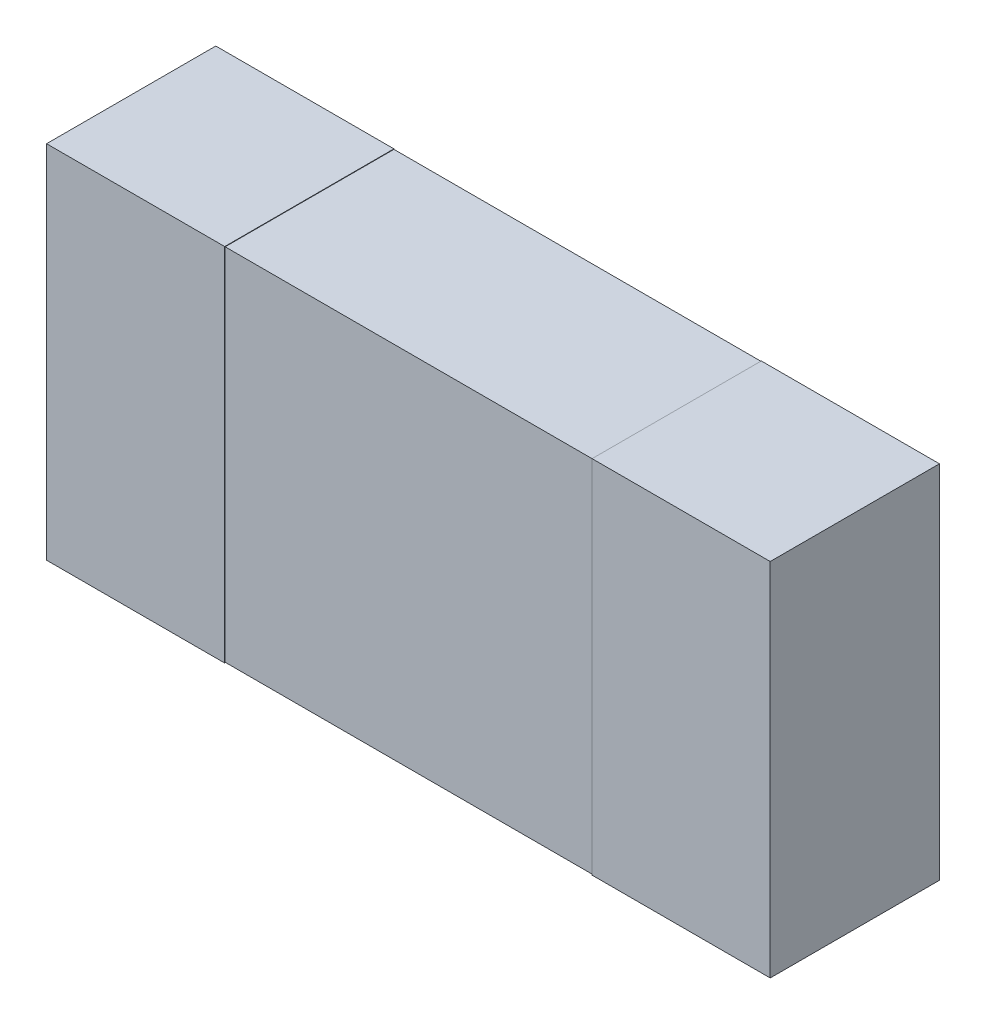
ISO-10303-21;
HEADER;
FILE_DESCRIPTION(('STEP AP214'),'2;1');
FILE_NAME('part.step','',(''),(''),'','','');
FILE_SCHEMA(('AUTOMOTIVE_DESIGN { 1 0 10303 214 1 1 1 1 }'));
ENDSEC;
DATA;
#1=APPLICATION_CONTEXT('core data for automotive mechanical design processes');
#2=APPLICATION_PROTOCOL_DEFINITION('international standard','automotive_design',2000,#1);
#3=PRODUCT_CONTEXT('',#1,'mechanical');
#4=PRODUCT('Part','Part','',(#3));
#5=PRODUCT_RELATED_PRODUCT_CATEGORY('part','',(#4));
#6=PRODUCT_DEFINITION_FORMATION('','',#4);
#7=PRODUCT_DEFINITION_CONTEXT('part definition',#1,'design');
#8=PRODUCT_DEFINITION('design','',#6,#7);
#9=PRODUCT_DEFINITION_SHAPE('','',#8);
#10=(LENGTH_UNIT() NAMED_UNIT(*) SI_UNIT(.MILLI.,.METRE.));
#11=(NAMED_UNIT(*) PLANE_ANGLE_UNIT() SI_UNIT($,.RADIAN.));
#12=(NAMED_UNIT(*) SI_UNIT($,.STERADIAN.) SOLID_ANGLE_UNIT());
#13=UNCERTAINTY_MEASURE_WITH_UNIT(LENGTH_MEASURE(1.E-05),#10,'distance_accuracy_value','');
#14=(GEOMETRIC_REPRESENTATION_CONTEXT(3) GLOBAL_UNCERTAINTY_ASSIGNED_CONTEXT((#13)) GLOBAL_UNIT_ASSIGNED_CONTEXT((#10,
#11,#12)) REPRESENTATION_CONTEXT('',''));
#15=CARTESIAN_POINT('',(0.,0.,0.));
#16=DIRECTION('',(0.,0.,1.));
#17=DIRECTION('',(1.,0.,0.));
#18=AXIS2_PLACEMENT_3D('',#15,#16,#17);
#19=CARTESIAN_POINT('',(0.,0.,0.38));
#20=DIRECTION('',(0.,0.,1.));
#21=DIRECTION('',(1.,0.,0.));
#22=AXIS2_PLACEMENT_3D('',#19,#20,#21);
#23=PLANE('',#22);
#24=DIRECTION('',(0.,-1.,0.));
#25=VECTOR('',#24,1.);
#26=CARTESIAN_POINT('',(0.8125,0.405,0.38));
#27=LINE('',#26,#25);
#28=CARTESIAN_POINT('',(0.8125,-0.405,0.38));
#29=VERTEX_POINT('',#28);
#30=CARTESIAN_POINT('',(0.8125,0.405,0.38));
#31=VERTEX_POINT('',#30);
#32=EDGE_CURVE('E224',#29,#31,#27,.F.);
#33=ORIENTED_EDGE('',*,*,#32,.T.);
#34=DIRECTION('',(1.,0.,0.));
#35=VECTOR('',#34,1.);
#36=CARTESIAN_POINT('',(-0.8125,0.405,0.38));
#37=LINE('',#36,#35);
#38=CARTESIAN_POINT('',(0.4125,0.405,0.38));
#39=VERTEX_POINT('',#38);
#40=EDGE_CURVE('E218',#31,#39,#37,.F.);
#41=ORIENTED_EDGE('',*,*,#40,.T.);
#42=DIRECTION('',(0.,1.,0.));
#43=VECTOR('',#42,1.);
#44=CARTESIAN_POINT('',(0.4125,0.405,0.38));
#45=LINE('',#44,#43);
#46=CARTESIAN_POINT('',(0.412499999999956,-0.405,0.38));
#47=VERTEX_POINT('',#46);
#48=EDGE_CURVE('E212',#39,#47,#45,.F.);
#49=ORIENTED_EDGE('',*,*,#48,.T.);
#50=DIRECTION('',(1.,0.,0.));
#51=VECTOR('',#50,1.);
#52=CARTESIAN_POINT('',(-0.8125,-0.405,0.38));
#53=LINE('',#52,#51);
#54=EDGE_CURVE('E94',#47,#29,#53,.T.);
#55=ORIENTED_EDGE('',*,*,#54,.T.);
#56=EDGE_LOOP('',(#33,#41,#49,#55));
#57=FACE_BOUND('',#56,.T.);
#58=ADVANCED_FACE('F17',(#57),#23,.T.);
#59=CARTESIAN_POINT('',(0.,0.,0.38));
#60=DIRECTION('',(0.,0.,1.));
#61=DIRECTION('',(1.,0.,0.));
#62=AXIS2_PLACEMENT_3D('',#59,#60,#61);
#63=PLANE('',#62);
#64=DIRECTION('',(1.,0.,0.));
#65=VECTOR('',#64,1.);
#66=CARTESIAN_POINT('',(-0.8125,0.405,0.38));
#67=LINE('',#66,#65);
#68=CARTESIAN_POINT('',(-0.4125,0.405,0.38));
#69=VERTEX_POINT('',#68);
#70=CARTESIAN_POINT('',(-0.8125,0.405,0.38));
#71=VERTEX_POINT('',#70);
#72=EDGE_CURVE('E108',#69,#71,#67,.F.);
#73=ORIENTED_EDGE('',*,*,#72,.T.);
#74=DIRECTION('',(0.,1.,0.));
#75=VECTOR('',#74,1.);
#76=CARTESIAN_POINT('',(-0.8125,0.405,0.38));
#77=LINE('',#76,#75);
#78=CARTESIAN_POINT('',(-0.8125,-0.405,0.38));
#79=VERTEX_POINT('',#78);
#80=EDGE_CURVE('E137',#71,#79,#77,.F.);
#81=ORIENTED_EDGE('',*,*,#80,.T.);
#82=DIRECTION('',(1.,0.,0.));
#83=VECTOR('',#82,1.);
#84=CARTESIAN_POINT('',(-0.8125,-0.405,0.38));
#85=LINE('',#84,#83);
#86=CARTESIAN_POINT('',(-0.4125,-0.405,0.38));
#87=VERTEX_POINT('',#86);
#88=EDGE_CURVE('E120',#79,#87,#85,.T.);
#89=ORIENTED_EDGE('',*,*,#88,.T.);
#90=DIRECTION('',(0.,1.,0.));
#91=VECTOR('',#90,1.);
#92=CARTESIAN_POINT('',(-0.4125,0.405,0.38));
#93=LINE('',#92,#91);
#94=EDGE_CURVE('E185',#87,#69,#93,.T.);
#95=ORIENTED_EDGE('',*,*,#94,.T.);
#96=EDGE_LOOP('',(#73,#81,#89,#95));
#97=FACE_BOUND('',#96,.T.);
#98=ADVANCED_FACE('F289',(#97),#63,.T.);
#99=CARTESIAN_POINT('',(0.4125,-0.405,0.379));
#100=DIRECTION('',(0.,0.,-1.));
#101=DIRECTION('',(-1.,0.,0.));
#102=AXIS2_PLACEMENT_3D('',#99,#100,#101);
#103=PLANE('',#102);
#104=DIRECTION('',(1.,0.,0.));
#105=VECTOR('',#104,1.);
#106=CARTESIAN_POINT('',(0.4125,0.404,0.379));
#107=LINE('',#106,#105);
#108=CARTESIAN_POINT('',(0.4125,0.404,0.379));
#109=VERTEX_POINT('',#108);
#110=CARTESIAN_POINT('',(-0.4125,0.404,0.379));
#111=VERTEX_POINT('',#110);
#112=EDGE_CURVE('E115',#109,#111,#107,.F.);
#113=ORIENTED_EDGE('',*,*,#112,.T.);
#114=DIRECTION('',(0.,1.,0.));
#115=VECTOR('',#114,1.);
#116=CARTESIAN_POINT('',(-0.4125,0.405,0.379));
#117=LINE('',#116,#115);
#118=CARTESIAN_POINT('',(-0.4125,-0.404,0.379));
#119=VERTEX_POINT('',#118);
#120=EDGE_CURVE('E191',#111,#119,#117,.F.);
#121=ORIENTED_EDGE('',*,*,#120,.T.);
#122=DIRECTION('',(1.,0.,0.));
#123=VECTOR('',#122,1.);
#124=CARTESIAN_POINT('',(0.4125,-0.404,0.379));
#125=LINE('',#124,#123);
#126=CARTESIAN_POINT('',(0.412499999999985,-0.404,0.379));
#127=VERTEX_POINT('',#126);
#128=EDGE_CURVE('E177',#119,#127,#125,.T.);
#129=ORIENTED_EDGE('',*,*,#128,.T.);
#130=DIRECTION('',(0.,1.,0.));
#131=VECTOR('',#130,1.);
#132=CARTESIAN_POINT('',(0.4125,0.405,0.379));
#133=LINE('',#132,#131);
#134=EDGE_CURVE('E69',#127,#109,#133,.T.);
#135=ORIENTED_EDGE('',*,*,#134,.T.);
#136=EDGE_LOOP('',(#113,#121,#129,#135));
#137=FACE_BOUND('',#136,.T.);
#138=ADVANCED_FACE('F294',(#137),#103,.F.);
#139=CARTESIAN_POINT('',(-0.8125,-0.405,0.38));
#140=DIRECTION('',(0.,1.,0.));
#141=DIRECTION('',(0.,0.,1.));
#142=AXIS2_PLACEMENT_3D('',#139,#140,#141);
#143=PLANE('',#142);
#144=DIRECTION('',(0.,0.,1.));
#145=VECTOR('',#144,1.);
#146=CARTESIAN_POINT('',(0.412499999999956,-0.405,0.38));
#147=LINE('',#146,#145);
#148=CARTESIAN_POINT('',(0.412499999999956,-0.405,0.));
#149=VERTEX_POINT('',#148);
#150=EDGE_CURVE('E210',#47,#149,#147,.F.);
#151=ORIENTED_EDGE('',*,*,#150,.T.);
#152=DIRECTION('',(1.,0.,0.));
#153=VECTOR('',#152,1.);
#154=CARTESIAN_POINT('',(0.,-0.405,0.));
#155=LINE('',#154,#153);
#156=CARTESIAN_POINT('',(0.8125,-0.405,0.));
#157=VERTEX_POINT('',#156);
#158=EDGE_CURVE('E171',#149,#157,#155,.T.);
#159=ORIENTED_EDGE('',*,*,#158,.T.);
#160=DIRECTION('',(0.,0.,1.));
#161=VECTOR('',#160,1.);
#162=CARTESIAN_POINT('',(0.8125,-0.405,0.38));
#163=LINE('',#162,#161);
#164=EDGE_CURVE('E231',#157,#29,#163,.T.);
#165=ORIENTED_EDGE('',*,*,#164,.T.);
#166=ORIENTED_EDGE('',*,*,#54,.F.);
#167=EDGE_LOOP('',(#151,#159,#165,#166));
#168=FACE_BOUND('',#167,.T.);
#169=ADVANCED_FACE('F286',(#168),#143,.F.);
#170=CARTESIAN_POINT('',(0.8125,0.405,0.38));
#171=DIRECTION('',(-1.,0.,0.));
#172=DIRECTION('',(0.,-1.,0.));
#173=AXIS2_PLACEMENT_3D('',#170,#171,#172);
#174=PLANE('',#173);
#175=DIRECTION('',(0.,0.,-1.));
#176=VECTOR('',#175,1.);
#177=CARTESIAN_POINT('',(0.8125,0.405,0.38));
#178=LINE('',#177,#176);
#179=CARTESIAN_POINT('',(0.8125,0.405,0.));
#180=VERTEX_POINT('',#179);
#181=EDGE_CURVE('E221',#180,#31,#178,.F.);
#182=ORIENTED_EDGE('',*,*,#181,.T.);
#183=ORIENTED_EDGE('',*,*,#32,.F.);
#184=ORIENTED_EDGE('',*,*,#164,.F.);
#185=DIRECTION('',(0.,1.,0.));
#186=VECTOR('',#185,1.);
#187=CARTESIAN_POINT('',(0.8125,0.,0.));
#188=LINE('',#187,#186);
#189=EDGE_CURVE('E168',#157,#180,#188,.T.);
#190=ORIENTED_EDGE('',*,*,#189,.T.);
#191=EDGE_LOOP('',(#182,#183,#184,#190));
#192=FACE_BOUND('',#191,.T.);
#193=ADVANCED_FACE('F285',(#192),#174,.F.);
#194=CARTESIAN_POINT('',(-0.8125,0.405,0.38));
#195=DIRECTION('',(0.,-1.,0.));
#196=DIRECTION('',(0.,0.,-1.));
#197=AXIS2_PLACEMENT_3D('',#194,#195,#196);
#198=PLANE('',#197);
#199=DIRECTION('',(0.,0.,1.));
#200=VECTOR('',#199,1.);
#201=CARTESIAN_POINT('',(0.4125,0.405,0.38));
#202=LINE('',#201,#200);
#203=CARTESIAN_POINT('',(0.4125,0.405,0.));
#204=VERTEX_POINT('',#203);
#205=EDGE_CURVE('E215',#204,#39,#202,.T.);
#206=ORIENTED_EDGE('',*,*,#205,.T.);
#207=ORIENTED_EDGE('',*,*,#40,.F.);
#208=ORIENTED_EDGE('',*,*,#181,.F.);
#209=DIRECTION('',(1.,0.,0.));
#210=VECTOR('',#209,1.);
#211=CARTESIAN_POINT('',(0.,0.405,0.));
#212=LINE('',#211,#210);
#213=EDGE_CURVE('E165',#180,#204,#212,.F.);
#214=ORIENTED_EDGE('',*,*,#213,.T.);
#215=EDGE_LOOP('',(#206,#207,#208,#214));
#216=FACE_BOUND('',#215,.T.);
#217=ADVANCED_FACE('F281',(#216),#198,.F.);
#218=CARTESIAN_POINT('',(0.4125,0.405,0.38));
#219=DIRECTION('',(1.,0.,0.));
#220=DIRECTION('',(0.,1.,0.));
#221=AXIS2_PLACEMENT_3D('',#218,#219,#220);
#222=PLANE('',#221);
#223=DIRECTION('',(0.,0.,1.));
#224=VECTOR('',#223,1.);
#225=CARTESIAN_POINT('',(0.4125,0.404,0.38));
#226=LINE('',#225,#224);
#227=CARTESIAN_POINT('',(0.4125,0.404,0.));
#228=VERTEX_POINT('',#227);
#229=EDGE_CURVE('E206',#228,#109,#226,.T.);
#230=ORIENTED_EDGE('',*,*,#229,.T.);
#231=ORIENTED_EDGE('',*,*,#134,.F.);
#232=DIRECTION('',(0.,0.,1.));
#233=VECTOR('',#232,1.);
#234=CARTESIAN_POINT('',(0.4125,-0.404,0.38));
#235=LINE('',#234,#233);
#236=CARTESIAN_POINT('',(0.412499999999978,-0.404,0.));
#237=VERTEX_POINT('',#236);
#238=EDGE_CURVE('E180',#127,#237,#235,.F.);
#239=ORIENTED_EDGE('',*,*,#238,.T.);
#240=DIRECTION('',(0.,1.,0.));
#241=VECTOR('',#240,1.);
#242=CARTESIAN_POINT('',(0.4125,0.405,0.));
#243=LINE('',#242,#241);
#244=EDGE_CURVE('E20',#237,#149,#243,.F.);
#245=ORIENTED_EDGE('',*,*,#244,.T.);
#246=ORIENTED_EDGE('',*,*,#150,.F.);
#247=ORIENTED_EDGE('',*,*,#48,.F.);
#248=ORIENTED_EDGE('',*,*,#205,.F.);
#249=DIRECTION('',(0.,1.,0.));
#250=VECTOR('',#249,1.);
#251=CARTESIAN_POINT('',(0.4125,0.405,0.));
#252=LINE('',#251,#250);
#253=EDGE_CURVE('E164',#204,#228,#252,.F.);
#254=ORIENTED_EDGE('',*,*,#253,.T.);
#255=EDGE_LOOP('',(#230,#231,#239,#245,#246,#247,#248,#254));
#256=FACE_BOUND('',#255,.T.);
#257=ADVANCED_FACE('F275',(#256),#222,.F.);
#258=CARTESIAN_POINT('',(0.4125,0.404,0.38));
#259=DIRECTION('',(0.,-1.,0.));
#260=DIRECTION('',(1.,0.,0.));
#261=AXIS2_PLACEMENT_3D('',#258,#259,#260);
#262=PLANE('',#261);
#263=ORIENTED_EDGE('',*,*,#112,.F.);
#264=ORIENTED_EDGE('',*,*,#229,.F.);
#265=DIRECTION('',(1.,0.,0.));
#266=VECTOR('',#265,1.);
#267=CARTESIAN_POINT('',(0.,0.404,0.));
#268=LINE('',#267,#266);
#269=CARTESIAN_POINT('',(-0.4125,0.404,0.));
#270=VERTEX_POINT('',#269);
#271=EDGE_CURVE('E154',#228,#270,#268,.F.);
#272=ORIENTED_EDGE('',*,*,#271,.T.);
#273=DIRECTION('',(0.,0.,1.));
#274=VECTOR('',#273,1.);
#275=CARTESIAN_POINT('',(-0.4125,0.404,0.38));
#276=LINE('',#275,#274);
#277=EDGE_CURVE('E194',#270,#111,#276,.T.);
#278=ORIENTED_EDGE('',*,*,#277,.T.);
#279=EDGE_LOOP('',(#263,#264,#272,#278));
#280=FACE_BOUND('',#279,.T.);
#281=ADVANCED_FACE('F314',(#280),#262,.F.);
#282=CARTESIAN_POINT('',(-0.8125,0.405,0.38));
#283=DIRECTION('',(0.,-1.,0.));
#284=DIRECTION('',(0.,0.,-1.));
#285=AXIS2_PLACEMENT_3D('',#282,#283,#284);
#286=PLANE('',#285);
#287=DIRECTION('',(0.,0.,1.));
#288=VECTOR('',#287,1.);
#289=CARTESIAN_POINT('',(-0.4125,0.405,0.38));
#290=LINE('',#289,#288);
#291=CARTESIAN_POINT('',(-0.4125,0.405,0.));
#292=VERTEX_POINT('',#291);
#293=EDGE_CURVE('E151',#69,#292,#290,.F.);
#294=ORIENTED_EDGE('',*,*,#293,.T.);
#295=DIRECTION('',(1.,0.,0.));
#296=VECTOR('',#295,1.);
#297=CARTESIAN_POINT('',(0.,0.405,0.));
#298=LINE('',#297,#296);
#299=CARTESIAN_POINT('',(-0.8125,0.405,0.));
#300=VERTEX_POINT('',#299);
#301=EDGE_CURVE('E145',#292,#300,#298,.F.);
#302=ORIENTED_EDGE('',*,*,#301,.T.);
#303=DIRECTION('',(0.,0.,1.));
#304=VECTOR('',#303,1.);
#305=CARTESIAN_POINT('',(-0.8125,0.405,0.38));
#306=LINE('',#305,#304);
#307=EDGE_CURVE('E133',#300,#71,#306,.T.);
#308=ORIENTED_EDGE('',*,*,#307,.T.);
#309=ORIENTED_EDGE('',*,*,#72,.F.);
#310=EDGE_LOOP('',(#294,#302,#308,#309));
#311=FACE_BOUND('',#310,.T.);
#312=ADVANCED_FACE('F149',(#311),#286,.F.);
#313=CARTESIAN_POINT('',(-0.8125,0.405,0.38));
#314=DIRECTION('',(1.,0.,0.));
#315=DIRECTION('',(0.,1.,0.));
#316=AXIS2_PLACEMENT_3D('',#313,#314,#315);
#317=PLANE('',#316);
#318=DIRECTION('',(0.,0.,1.));
#319=VECTOR('',#318,1.);
#320=CARTESIAN_POINT('',(-0.8125,-0.405,0.38));
#321=LINE('',#320,#319);
#322=CARTESIAN_POINT('',(-0.8125,-0.405,0.));
#323=VERTEX_POINT('',#322);
#324=EDGE_CURVE('E127',#323,#79,#321,.T.);
#325=ORIENTED_EDGE('',*,*,#324,.T.);
#326=ORIENTED_EDGE('',*,*,#80,.F.);
#327=ORIENTED_EDGE('',*,*,#307,.F.);
#328=DIRECTION('',(0.,1.,0.));
#329=VECTOR('',#328,1.);
#330=CARTESIAN_POINT('',(-0.8125,0.,0.));
#331=LINE('',#330,#329);
#332=EDGE_CURVE('E136',#300,#323,#331,.F.);
#333=ORIENTED_EDGE('',*,*,#332,.T.);
#334=EDGE_LOOP('',(#325,#326,#327,#333));
#335=FACE_BOUND('',#334,.T.);
#336=ADVANCED_FACE('F135',(#335),#317,.F.);
#337=CARTESIAN_POINT('',(-0.8125,-0.405,0.38));
#338=DIRECTION('',(0.,1.,0.));
#339=DIRECTION('',(0.,0.,1.));
#340=AXIS2_PLACEMENT_3D('',#337,#338,#339);
#341=PLANE('',#340);
#342=DIRECTION('',(0.,0.,1.));
#343=VECTOR('',#342,1.);
#344=CARTESIAN_POINT('',(-0.4125,-0.405,0.38));
#345=LINE('',#344,#343);
#346=CARTESIAN_POINT('',(-0.4125,-0.405,0.));
#347=VERTEX_POINT('',#346);
#348=EDGE_CURVE('E188',#347,#87,#345,.T.);
#349=ORIENTED_EDGE('',*,*,#348,.T.);
#350=ORIENTED_EDGE('',*,*,#88,.F.);
#351=ORIENTED_EDGE('',*,*,#324,.F.);
#352=DIRECTION('',(1.,0.,0.));
#353=VECTOR('',#352,1.);
#354=CARTESIAN_POINT('',(0.,-0.405,0.));
#355=LINE('',#354,#353);
#356=EDGE_CURVE('E147',#323,#347,#355,.T.);
#357=ORIENTED_EDGE('',*,*,#356,.T.);
#358=EDGE_LOOP('',(#349,#350,#351,#357));
#359=FACE_BOUND('',#358,.T.);
#360=ADVANCED_FACE('F306',(#359),#341,.F.);
#361=CARTESIAN_POINT('',(-0.4125,0.405,0.38));
#362=DIRECTION('',(-1.,0.,0.));
#363=DIRECTION('',(0.,0.,1.));
#364=AXIS2_PLACEMENT_3D('',#361,#362,#363);
#365=PLANE('',#364);
#366=ORIENTED_EDGE('',*,*,#293,.F.);
#367=ORIENTED_EDGE('',*,*,#94,.F.);
#368=ORIENTED_EDGE('',*,*,#348,.F.);
#369=DIRECTION('',(0.,1.,0.));
#370=VECTOR('',#369,1.);
#371=CARTESIAN_POINT('',(-0.4125,0.405,0.));
#372=LINE('',#371,#370);
#373=CARTESIAN_POINT('',(-0.4125,-0.404,0.));
#374=VERTEX_POINT('',#373);
#375=EDGE_CURVE('E26',#347,#374,#372,.T.);
#376=ORIENTED_EDGE('',*,*,#375,.T.);
#377=DIRECTION('',(0.,0.,1.));
#378=VECTOR('',#377,1.);
#379=CARTESIAN_POINT('',(-0.4125,-0.404,0.38));
#380=LINE('',#379,#378);
#381=EDGE_CURVE('E34',#374,#119,#380,.T.);
#382=ORIENTED_EDGE('',*,*,#381,.T.);
#383=ORIENTED_EDGE('',*,*,#120,.F.);
#384=ORIENTED_EDGE('',*,*,#277,.F.);
#385=DIRECTION('',(0.,1.,0.));
#386=VECTOR('',#385,1.);
#387=CARTESIAN_POINT('',(-0.4125,0.405,0.));
#388=LINE('',#387,#386);
#389=EDGE_CURVE('E152',#270,#292,#388,.T.);
#390=ORIENTED_EDGE('',*,*,#389,.T.);
#391=EDGE_LOOP('',(#366,#367,#368,#376,#382,#383,#384,#390));
#392=FACE_BOUND('',#391,.T.);
#393=ADVANCED_FACE('F301',(#392),#365,.F.);
#394=CARTESIAN_POINT('',(0.4125,-0.404,0.38));
#395=DIRECTION('',(0.,1.,0.));
#396=DIRECTION('',(0.,0.,1.));
#397=AXIS2_PLACEMENT_3D('',#394,#395,#396);
#398=PLANE('',#397);
#399=ORIENTED_EDGE('',*,*,#128,.F.);
#400=ORIENTED_EDGE('',*,*,#381,.F.);
#401=DIRECTION('',(1.,0.,0.));
#402=VECTOR('',#401,1.);
#403=CARTESIAN_POINT('',(0.,-0.404,0.));
#404=LINE('',#403,#402);
#405=EDGE_CURVE('E11',#374,#237,#404,.T.);
#406=ORIENTED_EDGE('',*,*,#405,.T.);
#407=ORIENTED_EDGE('',*,*,#238,.F.);
#408=EDGE_LOOP('',(#399,#400,#406,#407));
#409=FACE_BOUND('',#408,.T.);
#410=ADVANCED_FACE('F296',(#409),#398,.F.);
#411=CARTESIAN_POINT('',(0.,0.,0.));
#412=DIRECTION('',(0.,0.,1.));
#413=DIRECTION('',(1.,0.,0.));
#414=AXIS2_PLACEMENT_3D('',#411,#412,#413);
#415=PLANE('',#414);
#416=ORIENTED_EDGE('',*,*,#375,.F.);
#417=ORIENTED_EDGE('',*,*,#356,.F.);
#418=ORIENTED_EDGE('',*,*,#332,.F.);
#419=ORIENTED_EDGE('',*,*,#301,.F.);
#420=ORIENTED_EDGE('',*,*,#389,.F.);
#421=ORIENTED_EDGE('',*,*,#271,.F.);
#422=ORIENTED_EDGE('',*,*,#253,.F.);
#423=ORIENTED_EDGE('',*,*,#213,.F.);
#424=ORIENTED_EDGE('',*,*,#189,.F.);
#425=ORIENTED_EDGE('',*,*,#158,.F.);
#426=ORIENTED_EDGE('',*,*,#244,.F.);
#427=ORIENTED_EDGE('',*,*,#405,.F.);
#428=EDGE_LOOP('',(#416,#417,#418,#419,#420,#421,#422,#423,#424,#425,#426,#427));
#429=FACE_BOUND('',#428,.T.);
#430=ADVANCED_FACE('F143',(#429),#415,.F.);
#431=CLOSED_SHELL('',(#58,#98,#138,#169,#193,#217,#257,#281,#312,#336,#360,#393,#410,#430));
#432=MANIFOLD_SOLID_BREP('B1',#431);
#433=ADVANCED_BREP_SHAPE_REPRESENTATION('',(#18,#432),#14);
#434=SHAPE_DEFINITION_REPRESENTATION(#9,#433);
ENDSEC;
END-ISO-10303-21;
